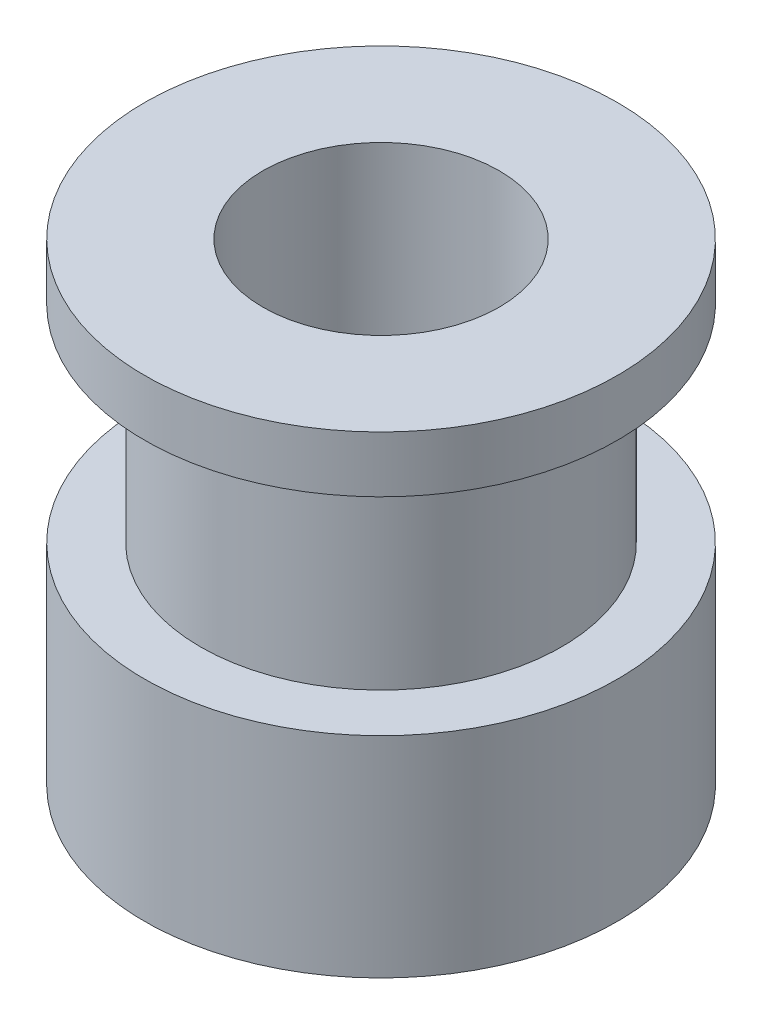
ISO-10303-21;
HEADER;
FILE_DESCRIPTION(('STEP AP214'),'2;1');
FILE_NAME('part.step','',(''),(''),'','','');
FILE_SCHEMA(('AUTOMOTIVE_DESIGN { 1 0 10303 214 1 1 1 1 }'));
ENDSEC;
DATA;
#1=APPLICATION_CONTEXT('core data for automotive mechanical design processes');
#2=APPLICATION_PROTOCOL_DEFINITION('international standard','automotive_design',2000,#1);
#3=PRODUCT_CONTEXT('',#1,'mechanical');
#4=PRODUCT('Part','Part','',(#3));
#5=PRODUCT_RELATED_PRODUCT_CATEGORY('part','',(#4));
#6=PRODUCT_DEFINITION_FORMATION('','',#4);
#7=PRODUCT_DEFINITION_CONTEXT('part definition',#1,'design');
#8=PRODUCT_DEFINITION('design','',#6,#7);
#9=PRODUCT_DEFINITION_SHAPE('','',#8);
#10=(LENGTH_UNIT() NAMED_UNIT(*) SI_UNIT(.MILLI.,.METRE.));
#11=(NAMED_UNIT(*) PLANE_ANGLE_UNIT() SI_UNIT($,.RADIAN.));
#12=(NAMED_UNIT(*) SI_UNIT($,.STERADIAN.) SOLID_ANGLE_UNIT());
#13=UNCERTAINTY_MEASURE_WITH_UNIT(LENGTH_MEASURE(1.E-05),#10,'distance_accuracy_value','');
#14=(GEOMETRIC_REPRESENTATION_CONTEXT(3) GLOBAL_UNCERTAINTY_ASSIGNED_CONTEXT((#13)) GLOBAL_UNIT_ASSIGNED_CONTEXT((#10,
#11,#12)) REPRESENTATION_CONTEXT('',''));
#15=CARTESIAN_POINT('',(0.,0.,0.));
#16=DIRECTION('',(0.,0.,1.));
#17=DIRECTION('',(1.,0.,0.));
#18=AXIS2_PLACEMENT_3D('',#15,#16,#17);
#19=CARTESIAN_POINT('',(0.,0.,8.));
#20=DIRECTION('',(0.,1.,0.));
#21=DIRECTION('',(0.,0.,1.));
#22=AXIS2_PLACEMENT_3D('',#19,#20,#21);
#23=PLANE('',#22);
#24=CARTESIAN_POINT('',(0.,0.,0.));
#25=DIRECTION('',(0.,-1.,0.));
#26=DIRECTION('',(0.,0.,-1.));
#27=AXIS2_PLACEMENT_3D('',#24,#25,#26);
#28=CIRCLE('',#27,4.);
#29=CARTESIAN_POINT('',(0.,0.,-4.));
#30=VERTEX_POINT('',#29);
#31=EDGE_CURVE('E10',#30,#30,#28,.T.);
#32=ORIENTED_EDGE('',*,*,#31,.F.);
#33=EDGE_LOOP('',(#32));
#34=FACE_BOUND('',#33,.T.);
#35=CARTESIAN_POINT('',(0.,0.,0.));
#36=DIRECTION('',(0.,-1.,0.));
#37=DIRECTION('',(0.,0.,-1.));
#38=AXIS2_PLACEMENT_3D('',#35,#36,#37);
#39=CIRCLE('',#38,8.);
#40=CARTESIAN_POINT('',(0.,0.,-8.));
#41=VERTEX_POINT('',#40);
#42=EDGE_CURVE('E59',#41,#41,#39,.T.);
#43=ORIENTED_EDGE('',*,*,#42,.T.);
#44=EDGE_LOOP('',(#43));
#45=FACE_BOUND('',#44,.T.);
#46=ADVANCED_FACE('F31',(#34,#45),#23,.F.);
#47=CARTESIAN_POINT('',(0.,0.,0.));
#48=DIRECTION('',(0.,-1.,0.));
#49=DIRECTION('',(0.,0.,-1.));
#50=AXIS2_PLACEMENT_3D('',#47,#48,#49);
#51=CYLINDRICAL_SURFACE('',#50,4.);
#52=CARTESIAN_POINT('',(0.,16.,0.));
#53=DIRECTION('',(0.,-1.,0.));
#54=DIRECTION('',(0.,0.,-1.));
#55=AXIS2_PLACEMENT_3D('',#52,#53,#54);
#56=CIRCLE('',#55,4.);
#57=CARTESIAN_POINT('',(0.,16.,-4.));
#58=VERTEX_POINT('',#57);
#59=EDGE_CURVE('E37',#58,#58,#56,.T.);
#60=ORIENTED_EDGE('',*,*,#59,.F.);
#61=EDGE_LOOP('',(#60));
#62=FACE_BOUND('',#61,.T.);
#63=ORIENTED_EDGE('',*,*,#31,.T.);
#64=EDGE_LOOP('',(#63));
#65=FACE_BOUND('',#64,.T.);
#66=ADVANCED_FACE('F96',(#62,#65),#51,.F.);
#67=CARTESIAN_POINT('',(0.,16.,4.));
#68=DIRECTION('',(0.,-1.,0.));
#69=DIRECTION('',(0.,0.,-1.));
#70=AXIS2_PLACEMENT_3D('',#67,#68,#69);
#71=PLANE('',#70);
#72=CARTESIAN_POINT('',(0.,16.,0.));
#73=DIRECTION('',(0.,-1.,0.));
#74=DIRECTION('',(0.,0.,-1.));
#75=AXIS2_PLACEMENT_3D('',#72,#73,#74);
#76=CIRCLE('',#75,8.);
#77=CARTESIAN_POINT('',(0.,16.,-8.));
#78=VERTEX_POINT('',#77);
#79=EDGE_CURVE('E41',#78,#78,#76,.T.);
#80=ORIENTED_EDGE('',*,*,#79,.F.);
#81=EDGE_LOOP('',(#80));
#82=FACE_BOUND('',#81,.T.);
#83=ORIENTED_EDGE('',*,*,#59,.T.);
#84=EDGE_LOOP('',(#83));
#85=FACE_BOUND('',#84,.T.);
#86=ADVANCED_FACE('F91',(#82,#85),#71,.F.);
#87=CARTESIAN_POINT('',(0.,0.,0.));
#88=DIRECTION('',(0.,-1.,0.));
#89=DIRECTION('',(0.,0.,-1.));
#90=AXIS2_PLACEMENT_3D('',#87,#88,#89);
#91=CYLINDRICAL_SURFACE('',#90,8.);
#92=CARTESIAN_POINT('',(0.,14.1,0.));
#93=DIRECTION('',(0.,-1.,0.));
#94=DIRECTION('',(0.,0.,-1.));
#95=AXIS2_PLACEMENT_3D('',#92,#93,#94);
#96=CIRCLE('',#95,8.);
#97=CARTESIAN_POINT('',(0.,14.1,-8.));
#98=VERTEX_POINT('',#97);
#99=EDGE_CURVE('E45',#98,#98,#96,.T.);
#100=ORIENTED_EDGE('',*,*,#99,.F.);
#101=EDGE_LOOP('',(#100));
#102=FACE_BOUND('',#101,.T.);
#103=ORIENTED_EDGE('',*,*,#79,.T.);
#104=EDGE_LOOP('',(#103));
#105=FACE_BOUND('',#104,.T.);
#106=ADVANCED_FACE('F85',(#102,#105),#91,.T.);
#107=CARTESIAN_POINT('',(0.,14.1,8.));
#108=DIRECTION('',(0.,1.,0.));
#109=DIRECTION('',(0.,0.,1.));
#110=AXIS2_PLACEMENT_3D('',#107,#108,#109);
#111=PLANE('',#110);
#112=CARTESIAN_POINT('',(0.,14.1,0.));
#113=DIRECTION('',(0.,-1.,0.));
#114=DIRECTION('',(0.,0.,-1.));
#115=AXIS2_PLACEMENT_3D('',#112,#113,#114);
#116=CIRCLE('',#115,6.11);
#117=CARTESIAN_POINT('',(0.,14.1,-6.11));
#118=VERTEX_POINT('',#117);
#119=EDGE_CURVE('E50',#118,#118,#116,.T.);
#120=ORIENTED_EDGE('',*,*,#119,.F.);
#121=EDGE_LOOP('',(#120));
#122=FACE_BOUND('',#121,.T.);
#123=ORIENTED_EDGE('',*,*,#99,.T.);
#124=EDGE_LOOP('',(#123));
#125=FACE_BOUND('',#124,.T.);
#126=ADVANCED_FACE('F79',(#122,#125),#111,.F.);
#127=CARTESIAN_POINT('',(0.,0.,0.));
#128=DIRECTION('',(0.,-1.,0.));
#129=DIRECTION('',(0.,0.,-1.));
#130=AXIS2_PLACEMENT_3D('',#127,#128,#129);
#131=CYLINDRICAL_SURFACE('',#130,6.11);
#132=CARTESIAN_POINT('',(0.,7.1,0.));
#133=DIRECTION('',(0.,-1.,0.));
#134=DIRECTION('',(0.,0.,-1.));
#135=AXIS2_PLACEMENT_3D('',#132,#133,#134);
#136=CIRCLE('',#135,6.11);
#137=CARTESIAN_POINT('',(0.,7.1,-6.11));
#138=VERTEX_POINT('',#137);
#139=EDGE_CURVE('E53',#138,#138,#136,.T.);
#140=ORIENTED_EDGE('',*,*,#139,.F.);
#141=EDGE_LOOP('',(#140));
#142=FACE_BOUND('',#141,.T.);
#143=ORIENTED_EDGE('',*,*,#119,.T.);
#144=EDGE_LOOP('',(#143));
#145=FACE_BOUND('',#144,.T.);
#146=ADVANCED_FACE('F73',(#142,#145),#131,.T.);
#147=CARTESIAN_POINT('',(0.,7.1,6.11));
#148=DIRECTION('',(0.,-1.,0.));
#149=DIRECTION('',(0.,0.,-1.));
#150=AXIS2_PLACEMENT_3D('',#147,#148,#149);
#151=PLANE('',#150);
#152=CARTESIAN_POINT('',(0.,7.1,0.));
#153=DIRECTION('',(0.,-1.,0.));
#154=DIRECTION('',(0.,0.,-1.));
#155=AXIS2_PLACEMENT_3D('',#152,#153,#154);
#156=CIRCLE('',#155,8.);
#157=CARTESIAN_POINT('',(0.,7.1,-8.));
#158=VERTEX_POINT('',#157);
#159=EDGE_CURVE('E56',#158,#158,#156,.T.);
#160=ORIENTED_EDGE('',*,*,#159,.F.);
#161=EDGE_LOOP('',(#160));
#162=FACE_BOUND('',#161,.T.);
#163=ORIENTED_EDGE('',*,*,#139,.T.);
#164=EDGE_LOOP('',(#163));
#165=FACE_BOUND('',#164,.T.);
#166=ADVANCED_FACE('F67',(#162,#165),#151,.F.);
#167=CARTESIAN_POINT('',(0.,0.,0.));
#168=DIRECTION('',(0.,-1.,0.));
#169=DIRECTION('',(0.,0.,-1.));
#170=AXIS2_PLACEMENT_3D('',#167,#168,#169);
#171=CYLINDRICAL_SURFACE('',#170,8.);
#172=ORIENTED_EDGE('',*,*,#42,.F.);
#173=EDGE_LOOP('',(#172));
#174=FACE_BOUND('',#173,.T.);
#175=ORIENTED_EDGE('',*,*,#159,.T.);
#176=EDGE_LOOP('',(#175));
#177=FACE_BOUND('',#176,.T.);
#178=ADVANCED_FACE('F64',(#174,#177),#171,.T.);
#179=CLOSED_SHELL('',(#46,#66,#86,#106,#126,#146,#166,#178));
#180=MANIFOLD_SOLID_BREP('B2',#179);
#181=ADVANCED_BREP_SHAPE_REPRESENTATION('',(#18,#180),#14);
#182=SHAPE_DEFINITION_REPRESENTATION(#9,#181);
ENDSEC;
END-ISO-10303-21;
